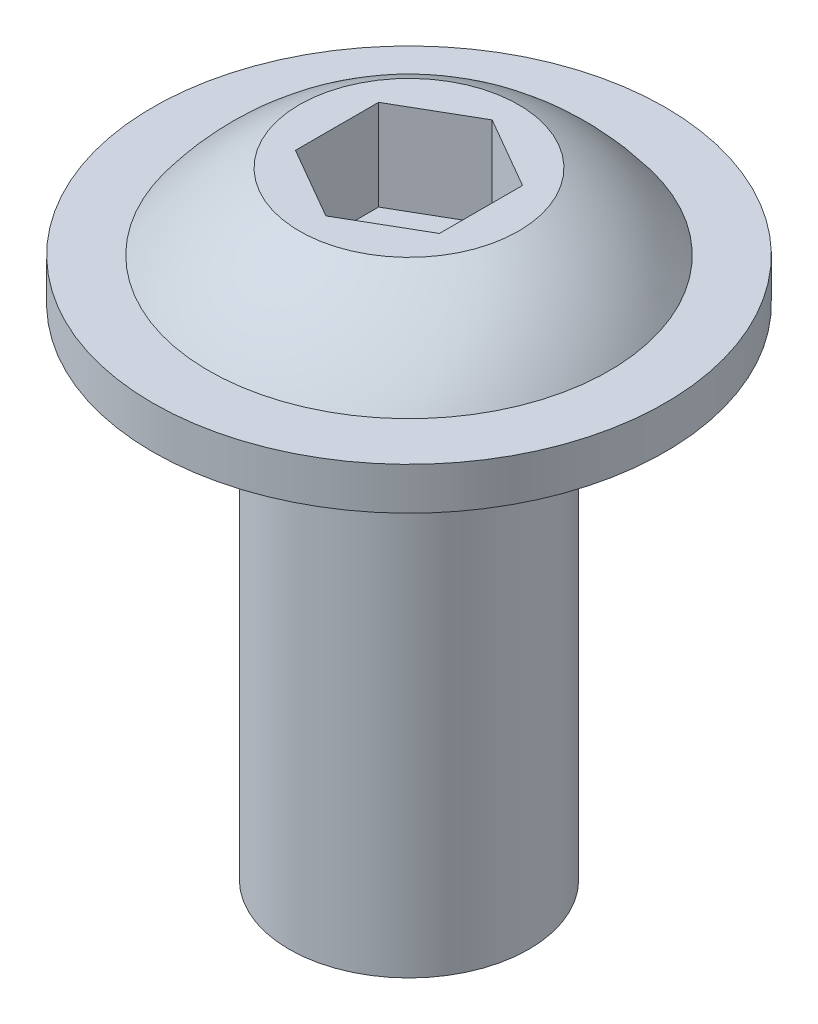
ISO-10303-21;
HEADER;
FILE_DESCRIPTION(('STEP AP214'),'2;1');
FILE_NAME('part.step','',(''),(''),'','','');
FILE_SCHEMA(('AUTOMOTIVE_DESIGN { 1 0 10303 214 1 1 1 1 }'));
ENDSEC;
DATA;
#1=APPLICATION_CONTEXT('core data for automotive mechanical design processes');
#2=APPLICATION_PROTOCOL_DEFINITION('international standard','automotive_design',2000,#1);
#3=PRODUCT_CONTEXT('',#1,'mechanical');
#4=PRODUCT('Part','Part','',(#3));
#5=PRODUCT_RELATED_PRODUCT_CATEGORY('part','',(#4));
#6=PRODUCT_DEFINITION_FORMATION('','',#4);
#7=PRODUCT_DEFINITION_CONTEXT('part definition',#1,'design');
#8=PRODUCT_DEFINITION('design','',#6,#7);
#9=PRODUCT_DEFINITION_SHAPE('','',#8);
#10=(LENGTH_UNIT() NAMED_UNIT(*) SI_UNIT(.MILLI.,.METRE.));
#11=(NAMED_UNIT(*) PLANE_ANGLE_UNIT() SI_UNIT($,.RADIAN.));
#12=(NAMED_UNIT(*) SI_UNIT($,.STERADIAN.) SOLID_ANGLE_UNIT());
#13=UNCERTAINTY_MEASURE_WITH_UNIT(LENGTH_MEASURE(1.E-05),#10,'distance_accuracy_value','');
#14=(GEOMETRIC_REPRESENTATION_CONTEXT(3) GLOBAL_UNCERTAINTY_ASSIGNED_CONTEXT((#13)) GLOBAL_UNIT_ASSIGNED_CONTEXT((#10,
#11,#12)) REPRESENTATION_CONTEXT('',''));
#15=CARTESIAN_POINT('',(0.,0.,0.));
#16=DIRECTION('',(0.,0.,1.));
#17=DIRECTION('',(1.,0.,0.));
#18=AXIS2_PLACEMENT_3D('',#15,#16,#17);
#19=CARTESIAN_POINT('',(0.,16.5,0.));
#20=DIRECTION('',(0.,-1.,0.));
#21=DIRECTION('',(0.,0.,-1.));
#22=AXIS2_PLACEMENT_3D('',#19,#20,#21);
#23=CYLINDRICAL_SURFACE('',#22,3.96875);
#24=CARTESIAN_POINT('',(0.,16.5,0.));
#25=DIRECTION('',(0.,1.,0.));
#26=DIRECTION('',(0.,0.,1.));
#27=AXIS2_PLACEMENT_3D('',#24,#25,#26);
#28=CIRCLE('',#27,3.96875);
#29=CARTESIAN_POINT('',(0.,16.5,3.96875));
#30=VERTEX_POINT('',#29);
#31=EDGE_CURVE('E40',#30,#30,#28,.T.);
#32=ORIENTED_EDGE('',*,*,#31,.F.);
#33=EDGE_LOOP('',(#32));
#34=FACE_BOUND('',#33,.T.);
#35=CARTESIAN_POINT('',(0.,0.,0.));
#36=DIRECTION('',(0.,1.,0.));
#37=DIRECTION('',(0.,0.,1.));
#38=AXIS2_PLACEMENT_3D('',#35,#36,#37);
#39=CIRCLE('',#38,3.96875);
#40=CARTESIAN_POINT('',(0.,0.,3.96875));
#41=VERTEX_POINT('',#40);
#42=EDGE_CURVE('E35',#41,#41,#39,.T.);
#43=ORIENTED_EDGE('',*,*,#42,.T.);
#44=EDGE_LOOP('',(#43));
#45=FACE_BOUND('',#44,.T.);
#46=ADVANCED_FACE('F32',(#34,#45),#23,.T.);
#47=CARTESIAN_POINT('',(0.,0.,0.));
#48=DIRECTION('',(0.,1.,0.));
#49=DIRECTION('',(0.,0.,1.));
#50=AXIS2_PLACEMENT_3D('',#47,#48,#49);
#51=PLANE('',#50);
#52=ORIENTED_EDGE('',*,*,#42,.F.);
#53=EDGE_LOOP('',(#52));
#54=FACE_BOUND('',#53,.T.);
#55=ADVANCED_FACE('F155',(#54),#51,.F.);
#56=CARTESIAN_POINT('',(0.,17.9,0.));
#57=DIRECTION('',(0.,-1.,0.));
#58=DIRECTION('',(0.,0.,-1.));
#59=AXIS2_PLACEMENT_3D('',#56,#57,#58);
#60=CYLINDRICAL_SURFACE('',#59,8.475);
#61=CARTESIAN_POINT('',(0.,17.9,0.));
#62=DIRECTION('',(0.,1.,0.));
#63=DIRECTION('',(0.,0.,1.));
#64=AXIS2_PLACEMENT_3D('',#61,#62,#63);
#65=CIRCLE('',#64,8.475);
#66=CARTESIAN_POINT('',(0.,17.9,8.475));
#67=VERTEX_POINT('',#66);
#68=EDGE_CURVE('E144',#67,#67,#65,.T.);
#69=ORIENTED_EDGE('',*,*,#68,.F.);
#70=EDGE_LOOP('',(#69));
#71=FACE_BOUND('',#70,.T.);
#72=CARTESIAN_POINT('',(0.,16.5,0.));
#73=DIRECTION('',(0.,1.,0.));
#74=DIRECTION('',(0.,0.,1.));
#75=AXIS2_PLACEMENT_3D('',#72,#73,#74);
#76=CIRCLE('',#75,8.475);
#77=CARTESIAN_POINT('',(0.,16.5,8.475));
#78=VERTEX_POINT('',#77);
#79=EDGE_CURVE('E143',#78,#78,#76,.T.);
#80=ORIENTED_EDGE('',*,*,#79,.T.);
#81=EDGE_LOOP('',(#80));
#82=FACE_BOUND('',#81,.T.);
#83=ADVANCED_FACE('F157',(#71,#82),#60,.T.);
#84=CARTESIAN_POINT('',(0.,17.9,0.));
#85=DIRECTION('',(0.,1.,0.));
#86=DIRECTION('',(0.,0.,1.));
#87=AXIS2_PLACEMENT_3D('',#84,#85,#86);
#88=PLANE('',#87);
#89=CARTESIAN_POINT('',(0.,17.9,0.));
#90=DIRECTION('',(0.,1.,0.));
#91=DIRECTION('',(-1.,0.,0.));
#92=AXIS2_PLACEMENT_3D('',#89,#90,#91);
#93=CIRCLE('',#92,6.625);
#94=CARTESIAN_POINT('',(-6.625,17.9,0.));
#95=VERTEX_POINT('',#94);
#96=EDGE_CURVE('E11',#95,#95,#93,.T.);
#97=ORIENTED_EDGE('',*,*,#96,.F.);
#98=EDGE_LOOP('',(#97));
#99=FACE_BOUND('',#98,.T.);
#100=ORIENTED_EDGE('',*,*,#68,.T.);
#101=EDGE_LOOP('',(#100));
#102=FACE_BOUND('',#101,.T.);
#103=ADVANCED_FACE('F162',(#99,#102),#88,.T.);
#104=CARTESIAN_POINT('',(0.,16.5,0.));
#105=DIRECTION('',(0.,1.,0.));
#106=DIRECTION('',(0.,0.,1.));
#107=AXIS2_PLACEMENT_3D('',#104,#105,#106);
#108=PLANE('',#107);
#109=ORIENTED_EDGE('',*,*,#31,.T.);
#110=EDGE_LOOP('',(#109));
#111=FACE_BOUND('',#110,.T.);
#112=ORIENTED_EDGE('',*,*,#79,.F.);
#113=EDGE_LOOP('',(#112));
#114=FACE_BOUND('',#113,.T.);
#115=ADVANCED_FACE('F167',(#111,#114),#108,.F.);
#116=CARTESIAN_POINT('',(0.,13.,0.));
#117=DIRECTION('',(0.,1.,0.));
#118=DIRECTION('',(-1.,0.,0.));
#119=AXIS2_PLACEMENT_3D('',#116,#117,#118);
#120=SPHERICAL_SURFACE('',#119,8.24018355378082);
#121=ORIENTED_EDGE('',*,*,#96,.T.);
#122=EDGE_LOOP('',(#121));
#123=FACE_BOUND('',#122,.T.);
#124=CARTESIAN_POINT('',(0.,20.4,0.));
#125=DIRECTION('',(0.,1.,0.));
#126=DIRECTION('',(-1.,0.,0.));
#127=AXIS2_PLACEMENT_3D('',#124,#125,#126);
#128=CIRCLE('',#127,3.625);
#129=CARTESIAN_POINT('',(-3.625,20.4,0.));
#130=VERTEX_POINT('',#129);
#131=EDGE_CURVE('E135',#130,#130,#128,.T.);
#132=ORIENTED_EDGE('',*,*,#131,.F.);
#133=EDGE_LOOP('',(#132));
#134=FACE_BOUND('',#133,.T.);
#135=ADVANCED_FACE('F170',(#123,#134),#120,.T.);
#136=CARTESIAN_POINT('',(-3.625,20.4,0.));
#137=DIRECTION('',(0.,1.,0.));
#138=DIRECTION('',(-1.,0.,0.));
#139=AXIS2_PLACEMENT_3D('',#136,#137,#138);
#140=PLANE('',#139);
#141=DIRECTION('',(-0.866025403784439,0.,0.5));
#142=VECTOR('',#141,1.);
#143=CARTESIAN_POINT('',(0.,20.4,-2.74963065701559));
#144=LINE('',#143,#142);
#145=CARTESIAN_POINT('',(0.,20.4,-2.74963065701559));
#146=VERTEX_POINT('',#145);
#147=CARTESIAN_POINT('',(-2.38125000000001,20.4,-1.3748153285078));
#148=VERTEX_POINT('',#147);
#149=EDGE_CURVE('E48',#146,#148,#144,.T.);
#150=ORIENTED_EDGE('',*,*,#149,.F.);
#151=DIRECTION('',(-0.866025403784439,0.,-0.5));
#152=VECTOR('',#151,1.);
#153=CARTESIAN_POINT('',(2.38124999999999,20.4,-1.3748153285078));
#154=LINE('',#153,#152);
#155=CARTESIAN_POINT('',(2.38124999999999,20.4,-1.3748153285078));
#156=VERTEX_POINT('',#155);
#157=EDGE_CURVE('E131',#156,#146,#154,.T.);
#158=ORIENTED_EDGE('',*,*,#157,.F.);
#159=DIRECTION('',(0.,0.,-1.));
#160=VECTOR('',#159,1.);
#161=CARTESIAN_POINT('',(2.38124999999999,20.4,1.3748153285078));
#162=LINE('',#161,#160);
#163=CARTESIAN_POINT('',(2.38124999999999,20.4,1.3748153285078));
#164=VERTEX_POINT('',#163);
#165=EDGE_CURVE('E129',#164,#156,#162,.T.);
#166=ORIENTED_EDGE('',*,*,#165,.F.);
#167=DIRECTION('',(0.866025403784438,0.,-0.5));
#168=VECTOR('',#167,1.);
#169=CARTESIAN_POINT('',(0.,20.4,2.74963065701559));
#170=LINE('',#169,#168);
#171=CARTESIAN_POINT('',(0.,20.4,2.74963065701559));
#172=VERTEX_POINT('',#171);
#173=EDGE_CURVE('E96',#172,#164,#170,.T.);
#174=ORIENTED_EDGE('',*,*,#173,.F.);
#175=DIRECTION('',(0.866025403784439,0.,0.5));
#176=VECTOR('',#175,1.);
#177=CARTESIAN_POINT('',(-2.38125000000001,20.4,1.3748153285078));
#178=LINE('',#177,#176);
#179=CARTESIAN_POINT('',(-2.38125000000001,20.4,1.3748153285078));
#180=VERTEX_POINT('',#179);
#181=EDGE_CURVE('E125',#180,#172,#178,.T.);
#182=ORIENTED_EDGE('',*,*,#181,.F.);
#183=DIRECTION('',(0.,0.,1.));
#184=VECTOR('',#183,1.);
#185=CARTESIAN_POINT('',(-2.38125000000001,20.4,-1.3748153285078));
#186=LINE('',#185,#184);
#187=EDGE_CURVE('E122',#148,#180,#186,.T.);
#188=ORIENTED_EDGE('',*,*,#187,.F.);
#189=EDGE_LOOP('',(#150,#158,#166,#174,#182,#188));
#190=FACE_BOUND('',#189,.T.);
#191=ORIENTED_EDGE('',*,*,#131,.T.);
#192=EDGE_LOOP('',(#191));
#193=FACE_BOUND('',#192,.T.);
#194=ADVANCED_FACE('F176',(#190,#193),#140,.T.);
#195=CARTESIAN_POINT('',(0.,17.4,-2.74963065701559));
#196=DIRECTION('',(-0.5,0.,-0.866025403784439));
#197=DIRECTION('',(-0.866025403784439,0.,0.5));
#198=AXIS2_PLACEMENT_3D('',#195,#196,#197);
#199=PLANE('',#198);
#200=ORIENTED_EDGE('',*,*,#149,.T.);
#201=DIRECTION('',(0.,1.,0.));
#202=VECTOR('',#201,1.);
#203=CARTESIAN_POINT('',(-2.38125000000001,17.4,-1.3748153285078));
#204=LINE('',#203,#202);
#205=CARTESIAN_POINT('',(-2.38125000000001,17.4,-1.3748153285078));
#206=VERTEX_POINT('',#205);
#207=EDGE_CURVE('E78',#206,#148,#204,.T.);
#208=ORIENTED_EDGE('',*,*,#207,.F.);
#209=DIRECTION('',(-0.866025403784439,0.,0.5));
#210=VECTOR('',#209,1.);
#211=CARTESIAN_POINT('',(0.,17.4,-2.74963065701559));
#212=LINE('',#211,#210);
#213=CARTESIAN_POINT('',(0.,17.4,-2.74963065701559));
#214=VERTEX_POINT('',#213);
#215=EDGE_CURVE('E133',#214,#206,#212,.T.);
#216=ORIENTED_EDGE('',*,*,#215,.F.);
#217=DIRECTION('',(0.,1.,0.));
#218=VECTOR('',#217,1.);
#219=CARTESIAN_POINT('',(0.,17.4,-2.74963065701559));
#220=LINE('',#219,#218);
#221=EDGE_CURVE('E56',#214,#146,#220,.T.);
#222=ORIENTED_EDGE('',*,*,#221,.T.);
#223=EDGE_LOOP('',(#200,#208,#216,#222));
#224=FACE_BOUND('',#223,.T.);
#225=ADVANCED_FACE('F180',(#224),#199,.F.);
#226=CARTESIAN_POINT('',(2.38124999999999,17.4,-1.3748153285078));
#227=DIRECTION('',(0.5,0.,-0.866025403784439));
#228=DIRECTION('',(-0.866025403784439,0.,-0.5));
#229=AXIS2_PLACEMENT_3D('',#226,#227,#228);
#230=PLANE('',#229);
#231=ORIENTED_EDGE('',*,*,#157,.T.);
#232=ORIENTED_EDGE('',*,*,#221,.F.);
#233=DIRECTION('',(-0.866025403784439,0.,-0.5));
#234=VECTOR('',#233,1.);
#235=CARTESIAN_POINT('',(2.38124999999999,17.4,-1.3748153285078));
#236=LINE('',#235,#234);
#237=CARTESIAN_POINT('',(2.38124999999999,17.4,-1.3748153285078));
#238=VERTEX_POINT('',#237);
#239=EDGE_CURVE('E108',#238,#214,#236,.T.);
#240=ORIENTED_EDGE('',*,*,#239,.F.);
#241=DIRECTION('',(0.,1.,0.));
#242=VECTOR('',#241,1.);
#243=CARTESIAN_POINT('',(2.38124999999999,17.4,-1.3748153285078));
#244=LINE('',#243,#242);
#245=EDGE_CURVE('E100',#238,#156,#244,.T.);
#246=ORIENTED_EDGE('',*,*,#245,.T.);
#247=EDGE_LOOP('',(#231,#232,#240,#246));
#248=FACE_BOUND('',#247,.T.);
#249=ADVANCED_FACE('F184',(#248),#230,.F.);
#250=CARTESIAN_POINT('',(2.38124999999999,17.4,1.3748153285078));
#251=DIRECTION('',(1.,0.,0.));
#252=DIRECTION('',(0.,1.,0.));
#253=AXIS2_PLACEMENT_3D('',#250,#251,#252);
#254=PLANE('',#253);
#255=ORIENTED_EDGE('',*,*,#165,.T.);
#256=ORIENTED_EDGE('',*,*,#245,.F.);
#257=DIRECTION('',(0.,0.,-1.));
#258=VECTOR('',#257,1.);
#259=CARTESIAN_POINT('',(2.38124999999999,17.4,1.3748153285078));
#260=LINE('',#259,#258);
#261=CARTESIAN_POINT('',(2.38124999999999,17.4,1.3748153285078));
#262=VERTEX_POINT('',#261);
#263=EDGE_CURVE('E104',#262,#238,#260,.T.);
#264=ORIENTED_EDGE('',*,*,#263,.F.);
#265=DIRECTION('',(0.,1.,0.));
#266=VECTOR('',#265,1.);
#267=CARTESIAN_POINT('',(2.38124999999999,17.4,1.3748153285078));
#268=LINE('',#267,#266);
#269=EDGE_CURVE('E89',#262,#164,#268,.T.);
#270=ORIENTED_EDGE('',*,*,#269,.T.);
#271=EDGE_LOOP('',(#255,#256,#264,#270));
#272=FACE_BOUND('',#271,.T.);
#273=ADVANCED_FACE('F105',(#272),#254,.F.);
#274=CARTESIAN_POINT('',(0.,17.4,2.74963065701559));
#275=DIRECTION('',(0.5,0.,0.866025403784439));
#276=DIRECTION('',(0.866025403784439,0.,-0.5));
#277=AXIS2_PLACEMENT_3D('',#274,#275,#276);
#278=PLANE('',#277);
#279=ORIENTED_EDGE('',*,*,#173,.T.);
#280=ORIENTED_EDGE('',*,*,#269,.F.);
#281=DIRECTION('',(0.866025403784438,0.,-0.5));
#282=VECTOR('',#281,1.);
#283=CARTESIAN_POINT('',(0.,17.4,2.74963065701559));
#284=LINE('',#283,#282);
#285=CARTESIAN_POINT('',(0.,17.4,2.74963065701559));
#286=VERTEX_POINT('',#285);
#287=EDGE_CURVE('E93',#286,#262,#284,.T.);
#288=ORIENTED_EDGE('',*,*,#287,.F.);
#289=DIRECTION('',(0.,1.,0.));
#290=VECTOR('',#289,1.);
#291=CARTESIAN_POINT('',(0.,17.4,2.74963065701559));
#292=LINE('',#291,#290);
#293=EDGE_CURVE('E101',#286,#172,#292,.T.);
#294=ORIENTED_EDGE('',*,*,#293,.T.);
#295=EDGE_LOOP('',(#279,#280,#288,#294));
#296=FACE_BOUND('',#295,.T.);
#297=ADVANCED_FACE('F91',(#296),#278,.F.);
#298=CARTESIAN_POINT('',(-2.38125000000001,17.4,1.3748153285078));
#299=DIRECTION('',(-0.5,0.,0.866025403784439));
#300=DIRECTION('',(0.866025403784439,0.,0.5));
#301=AXIS2_PLACEMENT_3D('',#298,#299,#300);
#302=PLANE('',#301);
#303=ORIENTED_EDGE('',*,*,#181,.T.);
#304=ORIENTED_EDGE('',*,*,#293,.F.);
#305=DIRECTION('',(0.866025403784439,0.,0.5));
#306=VECTOR('',#305,1.);
#307=CARTESIAN_POINT('',(-2.38125000000001,17.4,1.3748153285078));
#308=LINE('',#307,#306);
#309=CARTESIAN_POINT('',(-2.38125000000001,17.4,1.3748153285078));
#310=VERTEX_POINT('',#309);
#311=EDGE_CURVE('E114',#310,#286,#308,.T.);
#312=ORIENTED_EDGE('',*,*,#311,.F.);
#313=DIRECTION('',(0.,1.,0.));
#314=VECTOR('',#313,1.);
#315=CARTESIAN_POINT('',(-2.38125000000001,17.4,1.3748153285078));
#316=LINE('',#315,#314);
#317=EDGE_CURVE('E138',#310,#180,#316,.T.);
#318=ORIENTED_EDGE('',*,*,#317,.T.);
#319=EDGE_LOOP('',(#303,#304,#312,#318));
#320=FACE_BOUND('',#319,.T.);
#321=ADVANCED_FACE('F188',(#320),#302,.F.);
#322=CARTESIAN_POINT('',(-2.38125000000001,17.4,-1.3748153285078));
#323=DIRECTION('',(-1.,0.,0.));
#324=DIRECTION('',(0.,0.,1.));
#325=AXIS2_PLACEMENT_3D('',#322,#323,#324);
#326=PLANE('',#325);
#327=ORIENTED_EDGE('',*,*,#187,.T.);
#328=ORIENTED_EDGE('',*,*,#317,.F.);
#329=DIRECTION('',(0.,0.,1.));
#330=VECTOR('',#329,1.);
#331=CARTESIAN_POINT('',(-2.38125000000001,17.4,-1.3748153285078));
#332=LINE('',#331,#330);
#333=EDGE_CURVE('E116',#206,#310,#332,.T.);
#334=ORIENTED_EDGE('',*,*,#333,.F.);
#335=ORIENTED_EDGE('',*,*,#207,.T.);
#336=EDGE_LOOP('',(#327,#328,#334,#335));
#337=FACE_BOUND('',#336,.T.);
#338=ADVANCED_FACE('F185',(#337),#326,.F.);
#339=CARTESIAN_POINT('',(0.,17.4,0.));
#340=DIRECTION('',(0.,1.,0.));
#341=DIRECTION('',(0.,0.,1.));
#342=AXIS2_PLACEMENT_3D('',#339,#340,#341);
#343=PLANE('',#342);
#344=ORIENTED_EDGE('',*,*,#215,.T.);
#345=ORIENTED_EDGE('',*,*,#333,.T.);
#346=ORIENTED_EDGE('',*,*,#311,.T.);
#347=ORIENTED_EDGE('',*,*,#287,.T.);
#348=ORIENTED_EDGE('',*,*,#263,.T.);
#349=ORIENTED_EDGE('',*,*,#239,.T.);
#350=EDGE_LOOP('',(#344,#345,#346,#347,#348,#349));
#351=FACE_BOUND('',#350,.T.);
#352=ADVANCED_FACE('F111',(#351),#343,.T.);
#353=CLOSED_SHELL('',(#46,#55,#83,#103,#115,#135,#194,#225,#249,#273,#297,#321,#338,#352));
#354=MANIFOLD_SOLID_BREP('B2',#353);
#355=ADVANCED_BREP_SHAPE_REPRESENTATION('',(#18,#354),#14);
#356=SHAPE_DEFINITION_REPRESENTATION(#9,#355);
ENDSEC;
END-ISO-10303-21;
